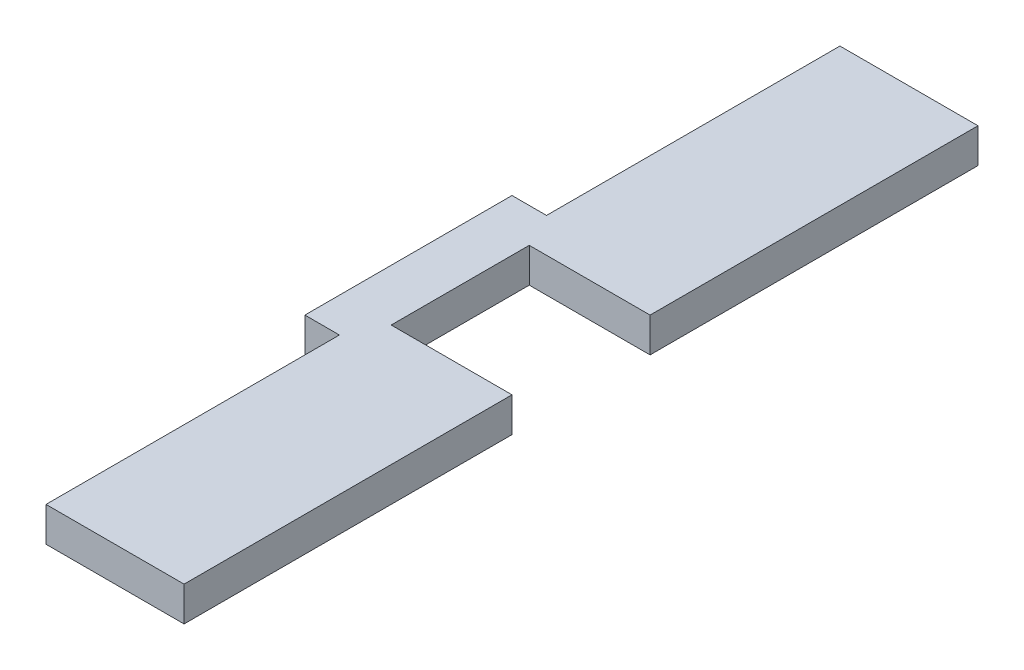
ISO-10303-21;
HEADER;
FILE_DESCRIPTION(('STEP AP214'),'2;1');
FILE_NAME('part.step','',(''),(''),'','','');
FILE_SCHEMA(('AUTOMOTIVE_DESIGN { 1 0 10303 214 1 1 1 1 }'));
ENDSEC;
DATA;
#1=APPLICATION_CONTEXT('core data for automotive mechanical design processes');
#2=APPLICATION_PROTOCOL_DEFINITION('international standard','automotive_design',2000,#1);
#3=PRODUCT_CONTEXT('',#1,'mechanical');
#4=PRODUCT('Part','Part','',(#3));
#5=PRODUCT_RELATED_PRODUCT_CATEGORY('part','',(#4));
#6=PRODUCT_DEFINITION_FORMATION('','',#4);
#7=PRODUCT_DEFINITION_CONTEXT('part definition',#1,'design');
#8=PRODUCT_DEFINITION('design','',#6,#7);
#9=PRODUCT_DEFINITION_SHAPE('','',#8);
#10=(LENGTH_UNIT() NAMED_UNIT(*) SI_UNIT(.MILLI.,.METRE.));
#11=(NAMED_UNIT(*) PLANE_ANGLE_UNIT() SI_UNIT($,.RADIAN.));
#12=(NAMED_UNIT(*) SI_UNIT($,.STERADIAN.) SOLID_ANGLE_UNIT());
#13=UNCERTAINTY_MEASURE_WITH_UNIT(LENGTH_MEASURE(1.E-05),#10,'distance_accuracy_value','');
#14=(GEOMETRIC_REPRESENTATION_CONTEXT(3) GLOBAL_UNCERTAINTY_ASSIGNED_CONTEXT((#13)) GLOBAL_UNIT_ASSIGNED_CONTEXT((#10,
#11,#12)) REPRESENTATION_CONTEXT('',''));
#15=CARTESIAN_POINT('',(0.,0.,0.));
#16=DIRECTION('',(0.,0.,1.));
#17=DIRECTION('',(1.,0.,0.));
#18=AXIS2_PLACEMENT_3D('',#15,#16,#17);
#19=CARTESIAN_POINT('',(12.7,3.175,0.));
#20=DIRECTION('',(-1.,0.,0.));
#21=DIRECTION('',(0.,0.,1.));
#22=AXIS2_PLACEMENT_3D('',#19,#20,#21);
#23=PLANE('',#22);
#24=DIRECTION('',(0.,0.,-1.));
#25=VECTOR('',#24,1.);
#26=CARTESIAN_POINT('',(12.7,0.,0.));
#27=LINE('',#26,#25);
#28=CARTESIAN_POINT('',(12.7,0.,-42.8625));
#29=VERTEX_POINT('',#28);
#30=CARTESIAN_POINT('',(12.7,0.,-73.025));
#31=VERTEX_POINT('',#30);
#32=EDGE_CURVE('E187',#29,#31,#27,.T.);
#33=ORIENTED_EDGE('',*,*,#32,.T.);
#34=DIRECTION('',(0.,-1.,0.));
#35=VECTOR('',#34,1.);
#36=CARTESIAN_POINT('',(12.7,3.175,-73.025));
#37=LINE('',#36,#35);
#38=CARTESIAN_POINT('',(12.7,3.175,-73.025));
#39=VERTEX_POINT('',#38);
#40=EDGE_CURVE('E194',#39,#31,#37,.T.);
#41=ORIENTED_EDGE('',*,*,#40,.F.);
#42=DIRECTION('',(0.,0.,-1.));
#43=VECTOR('',#42,1.);
#44=CARTESIAN_POINT('',(12.7,3.175,0.));
#45=LINE('',#44,#43);
#46=CARTESIAN_POINT('',(12.7,3.175,-42.8625));
#47=VERTEX_POINT('',#46);
#48=EDGE_CURVE('E251',#47,#39,#45,.T.);
#49=ORIENTED_EDGE('',*,*,#48,.F.);
#50=DIRECTION('',(0.,-1.,0.));
#51=VECTOR('',#50,1.);
#52=CARTESIAN_POINT('',(12.7,3.175,-42.8625));
#53=LINE('',#52,#51);
#54=EDGE_CURVE('E197',#47,#29,#53,.T.);
#55=ORIENTED_EDGE('',*,*,#54,.T.);
#56=EDGE_LOOP('',(#33,#41,#49,#55));
#57=FACE_BOUND('',#56,.T.);
#58=ADVANCED_FACE('F73',(#57),#23,.F.);
#59=CARTESIAN_POINT('',(0.,3.175,-42.8625));
#60=DIRECTION('',(0.,0.,-1.));
#61=DIRECTION('',(-1.,0.,0.));
#62=AXIS2_PLACEMENT_3D('',#59,#60,#61);
#63=PLANE('',#62);
#64=DIRECTION('',(1.,0.,0.));
#65=VECTOR('',#64,1.);
#66=CARTESIAN_POINT('',(0.,0.,-42.8625));
#67=LINE('',#66,#65);
#68=CARTESIAN_POINT('',(1.5875,0.,-42.8625));
#69=VERTEX_POINT('',#68);
#70=EDGE_CURVE('E184',#69,#29,#67,.T.);
#71=ORIENTED_EDGE('',*,*,#70,.T.);
#72=ORIENTED_EDGE('',*,*,#54,.F.);
#73=DIRECTION('',(1.,0.,0.));
#74=VECTOR('',#73,1.);
#75=CARTESIAN_POINT('',(0.,3.175,-42.8625));
#76=LINE('',#75,#74);
#77=CARTESIAN_POINT('',(1.5875,3.175,-42.8625));
#78=VERTEX_POINT('',#77);
#79=EDGE_CURVE('E249',#78,#47,#76,.T.);
#80=ORIENTED_EDGE('',*,*,#79,.F.);
#81=DIRECTION('',(0.,-1.,0.));
#82=VECTOR('',#81,1.);
#83=CARTESIAN_POINT('',(1.5875,3.175,-42.8625));
#84=LINE('',#83,#82);
#85=EDGE_CURVE('E200',#78,#69,#84,.T.);
#86=ORIENTED_EDGE('',*,*,#85,.T.);
#87=EDGE_LOOP('',(#71,#72,#80,#86));
#88=FACE_BOUND('',#87,.T.);
#89=ADVANCED_FACE('F295',(#88),#63,.F.);
#90=CARTESIAN_POINT('',(1.5875,3.175,0.));
#91=DIRECTION('',(1.,0.,0.));
#92=DIRECTION('',(0.,0.,-1.));
#93=AXIS2_PLACEMENT_3D('',#90,#91,#92);
#94=PLANE('',#93);
#95=DIRECTION('',(0.,0.,1.));
#96=VECTOR('',#95,1.);
#97=CARTESIAN_POINT('',(1.5875,0.,0.));
#98=LINE('',#97,#96);
#99=CARTESIAN_POINT('',(1.5875,0.,-30.1625));
#100=VERTEX_POINT('',#99);
#101=EDGE_CURVE('E181',#69,#100,#98,.T.);
#102=ORIENTED_EDGE('',*,*,#101,.F.);
#103=ORIENTED_EDGE('',*,*,#85,.F.);
#104=DIRECTION('',(0.,0.,1.));
#105=VECTOR('',#104,1.);
#106=CARTESIAN_POINT('',(1.5875,3.175,0.));
#107=LINE('',#106,#105);
#108=CARTESIAN_POINT('',(1.5875,3.175,-30.1625));
#109=VERTEX_POINT('',#108);
#110=EDGE_CURVE('E246',#78,#109,#107,.T.);
#111=ORIENTED_EDGE('',*,*,#110,.T.);
#112=DIRECTION('',(0.,-1.,0.));
#113=VECTOR('',#112,1.);
#114=CARTESIAN_POINT('',(1.5875,3.175,-30.1625));
#115=LINE('',#114,#113);
#116=EDGE_CURVE('E203',#109,#100,#115,.T.);
#117=ORIENTED_EDGE('',*,*,#116,.T.);
#118=EDGE_LOOP('',(#102,#103,#111,#117));
#119=FACE_BOUND('',#118,.T.);
#120=ADVANCED_FACE('F290',(#119),#94,.T.);
#121=CARTESIAN_POINT('',(0.,3.175,-30.1625));
#122=DIRECTION('',(0.,0.,-1.));
#123=DIRECTION('',(-1.,0.,0.));
#124=AXIS2_PLACEMENT_3D('',#121,#122,#123);
#125=PLANE('',#124);
#126=DIRECTION('',(1.,0.,0.));
#127=VECTOR('',#126,1.);
#128=CARTESIAN_POINT('',(0.,0.,-30.1625));
#129=LINE('',#128,#127);
#130=CARTESIAN_POINT('',(12.7,0.,-30.1625));
#131=VERTEX_POINT('',#130);
#132=EDGE_CURVE('E178',#100,#131,#129,.T.);
#133=ORIENTED_EDGE('',*,*,#132,.F.);
#134=ORIENTED_EDGE('',*,*,#116,.F.);
#135=DIRECTION('',(1.,0.,0.));
#136=VECTOR('',#135,1.);
#137=CARTESIAN_POINT('',(0.,3.175,-30.1625));
#138=LINE('',#137,#136);
#139=CARTESIAN_POINT('',(12.7,3.175,-30.1625));
#140=VERTEX_POINT('',#139);
#141=EDGE_CURVE('E240',#109,#140,#138,.T.);
#142=ORIENTED_EDGE('',*,*,#141,.T.);
#143=DIRECTION('',(0.,-1.,0.));
#144=VECTOR('',#143,1.);
#145=CARTESIAN_POINT('',(12.7,3.175,-30.1625));
#146=LINE('',#145,#144);
#147=EDGE_CURVE('E206',#140,#131,#146,.T.);
#148=ORIENTED_EDGE('',*,*,#147,.T.);
#149=EDGE_LOOP('',(#133,#134,#142,#148));
#150=FACE_BOUND('',#149,.T.);
#151=ADVANCED_FACE('F301',(#150),#125,.T.);
#152=CARTESIAN_POINT('',(12.7,3.175,0.));
#153=DIRECTION('',(-1.,0.,0.));
#154=DIRECTION('',(0.,0.,1.));
#155=AXIS2_PLACEMENT_3D('',#152,#153,#154);
#156=PLANE('',#155);
#157=DIRECTION('',(0.,0.,-1.));
#158=VECTOR('',#157,1.);
#159=CARTESIAN_POINT('',(12.7,0.,0.));
#160=LINE('',#159,#158);
#161=CARTESIAN_POINT('',(12.7,0.,0.));
#162=VERTEX_POINT('',#161);
#163=EDGE_CURVE('E175',#162,#131,#160,.T.);
#164=ORIENTED_EDGE('',*,*,#163,.T.);
#165=ORIENTED_EDGE('',*,*,#147,.F.);
#166=DIRECTION('',(0.,0.,-1.));
#167=VECTOR('',#166,1.);
#168=CARTESIAN_POINT('',(12.7,3.175,0.));
#169=LINE('',#168,#167);
#170=CARTESIAN_POINT('',(12.7,3.175,0.));
#171=VERTEX_POINT('',#170);
#172=EDGE_CURVE('E235',#171,#140,#169,.T.);
#173=ORIENTED_EDGE('',*,*,#172,.F.);
#174=DIRECTION('',(0.,-1.,0.));
#175=VECTOR('',#174,1.);
#176=CARTESIAN_POINT('',(12.7,3.175,0.));
#177=LINE('',#176,#175);
#178=EDGE_CURVE('E209',#171,#162,#177,.T.);
#179=ORIENTED_EDGE('',*,*,#178,.T.);
#180=EDGE_LOOP('',(#164,#165,#173,#179));
#181=FACE_BOUND('',#180,.T.);
#182=ADVANCED_FACE('F318',(#181),#156,.F.);
#183=CARTESIAN_POINT('',(0.,3.175,-73.025));
#184=DIRECTION('',(0.,0.,-1.));
#185=DIRECTION('',(-1.,0.,0.));
#186=AXIS2_PLACEMENT_3D('',#183,#184,#185);
#187=PLANE('',#186);
#188=DIRECTION('',(1.,0.,0.));
#189=VECTOR('',#188,1.);
#190=CARTESIAN_POINT('',(0.,0.,-73.025));
#191=LINE('',#190,#189);
#192=CARTESIAN_POINT('',(0.,0.,-73.025));
#193=VERTEX_POINT('',#192);
#194=EDGE_CURVE('E190',#193,#31,#191,.T.);
#195=ORIENTED_EDGE('',*,*,#194,.F.);
#196=DIRECTION('',(0.,-1.,0.));
#197=VECTOR('',#196,1.);
#198=CARTESIAN_POINT('',(0.,3.175,-73.025));
#199=LINE('',#198,#197);
#200=CARTESIAN_POINT('',(0.,3.175,-73.025));
#201=VERTEX_POINT('',#200);
#202=EDGE_CURVE('E155',#201,#193,#199,.T.);
#203=ORIENTED_EDGE('',*,*,#202,.F.);
#204=DIRECTION('',(1.,0.,0.));
#205=VECTOR('',#204,1.);
#206=CARTESIAN_POINT('',(0.,3.175,-73.025));
#207=LINE('',#206,#205);
#208=EDGE_CURVE('E170',#201,#39,#207,.T.);
#209=ORIENTED_EDGE('',*,*,#208,.T.);
#210=ORIENTED_EDGE('',*,*,#40,.T.);
#211=EDGE_LOOP('',(#195,#203,#209,#210));
#212=FACE_BOUND('',#211,.T.);
#213=ADVANCED_FACE('F256',(#212),#187,.T.);
#214=CARTESIAN_POINT('',(0.,3.175,0.));
#215=DIRECTION('',(0.,0.,-1.));
#216=DIRECTION('',(-1.,0.,0.));
#217=AXIS2_PLACEMENT_3D('',#214,#215,#216);
#218=PLANE('',#217);
#219=DIRECTION('',(1.,0.,0.));
#220=VECTOR('',#219,1.);
#221=CARTESIAN_POINT('',(0.,0.,0.));
#222=LINE('',#221,#220);
#223=CARTESIAN_POINT('',(0.,0.,0.));
#224=VERTEX_POINT('',#223);
#225=EDGE_CURVE('E158',#224,#162,#222,.T.);
#226=ORIENTED_EDGE('',*,*,#225,.T.);
#227=ORIENTED_EDGE('',*,*,#178,.F.);
#228=DIRECTION('',(1.,0.,0.));
#229=VECTOR('',#228,1.);
#230=CARTESIAN_POINT('',(0.,3.175,0.));
#231=LINE('',#230,#229);
#232=CARTESIAN_POINT('',(0.,3.175,0.));
#233=VERTEX_POINT('',#232);
#234=EDGE_CURVE('E233',#233,#171,#231,.T.);
#235=ORIENTED_EDGE('',*,*,#234,.F.);
#236=DIRECTION('',(0.,-1.,0.));
#237=VECTOR('',#236,1.);
#238=CARTESIAN_POINT('',(0.,3.175,0.));
#239=LINE('',#238,#237);
#240=EDGE_CURVE('E211',#233,#224,#239,.T.);
#241=ORIENTED_EDGE('',*,*,#240,.T.);
#242=EDGE_LOOP('',(#226,#227,#235,#241));
#243=FACE_BOUND('',#242,.T.);
#244=ADVANCED_FACE('F322',(#243),#218,.F.);
#245=CARTESIAN_POINT('',(0.,0.,0.));
#246=DIRECTION('',(0.,1.,0.));
#247=DIRECTION('',(0.,0.,1.));
#248=AXIS2_PLACEMENT_3D('',#245,#246,#247);
#249=PLANE('',#248);
#250=DIRECTION('',(0.,0.,-1.));
#251=VECTOR('',#250,1.);
#252=CARTESIAN_POINT('',(0.,0.,0.));
#253=LINE('',#252,#251);
#254=CARTESIAN_POINT('',(0.,0.,-26.9875));
#255=VERTEX_POINT('',#254);
#256=EDGE_CURVE('E134',#224,#255,#253,.T.);
#257=ORIENTED_EDGE('',*,*,#256,.T.);
#258=DIRECTION('',(-1.,0.,0.));
#259=VECTOR('',#258,1.);
#260=CARTESIAN_POINT('',(0.,0.,-26.9875));
#261=LINE('',#260,#259);
#262=CARTESIAN_POINT('',(-3.175,0.,-26.9875));
#263=VERTEX_POINT('',#262);
#264=EDGE_CURVE('E119',#255,#263,#261,.T.);
#265=ORIENTED_EDGE('',*,*,#264,.T.);
#266=DIRECTION('',(0.,0.,1.));
#267=VECTOR('',#266,1.);
#268=CARTESIAN_POINT('',(-3.175,0.,-46.0375));
#269=LINE('',#268,#267);
#270=CARTESIAN_POINT('',(-3.175,0.,-46.0375));
#271=VERTEX_POINT('',#270);
#272=EDGE_CURVE('E109',#271,#263,#269,.T.);
#273=ORIENTED_EDGE('',*,*,#272,.F.);
#274=DIRECTION('',(-1.,0.,0.));
#275=VECTOR('',#274,1.);
#276=CARTESIAN_POINT('',(0.,0.,-46.0375));
#277=LINE('',#276,#275);
#278=CARTESIAN_POINT('',(0.,0.,-46.0375));
#279=VERTEX_POINT('',#278);
#280=EDGE_CURVE('E129',#279,#271,#277,.T.);
#281=ORIENTED_EDGE('',*,*,#280,.F.);
#282=EDGE_CURVE('E151',#279,#193,#253,.T.);
#283=ORIENTED_EDGE('',*,*,#282,.T.);
#284=ORIENTED_EDGE('',*,*,#194,.T.);
#285=ORIENTED_EDGE('',*,*,#32,.F.);
#286=ORIENTED_EDGE('',*,*,#70,.F.);
#287=ORIENTED_EDGE('',*,*,#101,.T.);
#288=ORIENTED_EDGE('',*,*,#132,.T.);
#289=ORIENTED_EDGE('',*,*,#163,.F.);
#290=ORIENTED_EDGE('',*,*,#225,.F.);
#291=EDGE_LOOP('',(#257,#265,#273,#281,#283,#284,#285,#286,#287,#288,#289,#290));
#292=FACE_BOUND('',#291,.T.);
#293=ADVANCED_FACE('F131',(#292),#249,.F.);
#294=CARTESIAN_POINT('',(0.,3.175,0.));
#295=DIRECTION('',(0.,1.,0.));
#296=DIRECTION('',(0.,0.,1.));
#297=AXIS2_PLACEMENT_3D('',#294,#295,#296);
#298=PLANE('',#297);
#299=DIRECTION('',(0.,0.,-1.));
#300=VECTOR('',#299,1.);
#301=CARTESIAN_POINT('',(0.,3.175,0.));
#302=LINE('',#301,#300);
#303=CARTESIAN_POINT('',(0.,3.175,-26.9875));
#304=VERTEX_POINT('',#303);
#305=EDGE_CURVE('E164',#233,#304,#302,.T.);
#306=ORIENTED_EDGE('',*,*,#305,.F.);
#307=ORIENTED_EDGE('',*,*,#234,.T.);
#308=ORIENTED_EDGE('',*,*,#172,.T.);
#309=ORIENTED_EDGE('',*,*,#141,.F.);
#310=ORIENTED_EDGE('',*,*,#110,.F.);
#311=ORIENTED_EDGE('',*,*,#79,.T.);
#312=ORIENTED_EDGE('',*,*,#48,.T.);
#313=ORIENTED_EDGE('',*,*,#208,.F.);
#314=CARTESIAN_POINT('',(0.,3.175,-46.0375));
#315=VERTEX_POINT('',#314);
#316=EDGE_CURVE('E192',#315,#201,#302,.T.);
#317=ORIENTED_EDGE('',*,*,#316,.F.);
#318=DIRECTION('',(-1.,0.,0.));
#319=VECTOR('',#318,1.);
#320=CARTESIAN_POINT('',(0.,3.175,-46.0375));
#321=LINE('',#320,#319);
#322=CARTESIAN_POINT('',(-3.175,3.175,-46.0375));
#323=VERTEX_POINT('',#322);
#324=EDGE_CURVE('E135',#315,#323,#321,.T.);
#325=ORIENTED_EDGE('',*,*,#324,.T.);
#326=DIRECTION('',(0.,0.,1.));
#327=VECTOR('',#326,1.);
#328=CARTESIAN_POINT('',(-3.175,3.175,-46.0375));
#329=LINE('',#328,#327);
#330=CARTESIAN_POINT('',(-3.175,3.175,-26.9875));
#331=VERTEX_POINT('',#330);
#332=EDGE_CURVE('E138',#323,#331,#329,.T.);
#333=ORIENTED_EDGE('',*,*,#332,.T.);
#334=DIRECTION('',(-1.,0.,0.));
#335=VECTOR('',#334,1.);
#336=CARTESIAN_POINT('',(0.,3.175,-26.9875));
#337=LINE('',#336,#335);
#338=EDGE_CURVE('E122',#304,#331,#337,.T.);
#339=ORIENTED_EDGE('',*,*,#338,.F.);
#340=EDGE_LOOP('',(#306,#307,#308,#309,#310,#311,#312,#313,#317,#325,#333,#339));
#341=FACE_BOUND('',#340,.T.);
#342=ADVANCED_FACE('F227',(#341),#298,.T.);
#343=CARTESIAN_POINT('',(0.,3.175,0.));
#344=DIRECTION('',(-1.,0.,0.));
#345=DIRECTION('',(0.,0.,1.));
#346=AXIS2_PLACEMENT_3D('',#343,#344,#345);
#347=PLANE('',#346);
#348=ORIENTED_EDGE('',*,*,#305,.T.);
#349=DIRECTION('',(0.,-1.,0.));
#350=VECTOR('',#349,1.);
#351=CARTESIAN_POINT('',(0.,3.175,-26.9875));
#352=LINE('',#351,#350);
#353=EDGE_CURVE('E83',#304,#255,#352,.T.);
#354=ORIENTED_EDGE('',*,*,#353,.T.);
#355=ORIENTED_EDGE('',*,*,#256,.F.);
#356=ORIENTED_EDGE('',*,*,#240,.F.);
#357=EDGE_LOOP('',(#348,#354,#355,#356));
#358=FACE_BOUND('',#357,.T.);
#359=ADVANCED_FACE('F327',(#358),#347,.T.);
#360=DIRECTION('',(0.,-1.,0.));
#361=VECTOR('',#360,1.);
#362=CARTESIAN_POINT('',(0.,3.175,-46.0375));
#363=LINE('',#362,#361);
#364=EDGE_CURVE('E12',#315,#279,#363,.T.);
#365=ORIENTED_EDGE('',*,*,#364,.F.);
#366=ORIENTED_EDGE('',*,*,#316,.T.);
#367=ORIENTED_EDGE('',*,*,#202,.T.);
#368=ORIENTED_EDGE('',*,*,#282,.F.);
#369=EDGE_LOOP('',(#365,#366,#367,#368));
#370=FACE_BOUND('',#369,.T.);
#371=ADVANCED_FACE('F153',(#370),#347,.T.);
#372=CARTESIAN_POINT('',(-3.175,3.175,-46.0375));
#373=DIRECTION('',(1.,0.,0.));
#374=DIRECTION('',(0.,0.,-1.));
#375=AXIS2_PLACEMENT_3D('',#372,#373,#374);
#376=PLANE('',#375);
#377=ORIENTED_EDGE('',*,*,#272,.T.);
#378=DIRECTION('',(0.,-1.,0.));
#379=VECTOR('',#378,1.);
#380=CARTESIAN_POINT('',(-3.175,3.175,-26.9875));
#381=LINE('',#380,#379);
#382=EDGE_CURVE('E116',#331,#263,#381,.T.);
#383=ORIENTED_EDGE('',*,*,#382,.F.);
#384=ORIENTED_EDGE('',*,*,#332,.F.);
#385=DIRECTION('',(0.,-1.,0.));
#386=VECTOR('',#385,1.);
#387=CARTESIAN_POINT('',(-3.175,3.175,-46.0375));
#388=LINE('',#387,#386);
#389=EDGE_CURVE('E124',#323,#271,#388,.T.);
#390=ORIENTED_EDGE('',*,*,#389,.T.);
#391=EDGE_LOOP('',(#377,#383,#384,#390));
#392=FACE_BOUND('',#391,.T.);
#393=ADVANCED_FACE('F126',(#392),#376,.F.);
#394=CARTESIAN_POINT('',(0.,3.175,-26.9875));
#395=DIRECTION('',(0.,0.,1.));
#396=DIRECTION('',(1.,0.,0.));
#397=AXIS2_PLACEMENT_3D('',#394,#395,#396);
#398=PLANE('',#397);
#399=ORIENTED_EDGE('',*,*,#264,.F.);
#400=ORIENTED_EDGE('',*,*,#353,.F.);
#401=ORIENTED_EDGE('',*,*,#338,.T.);
#402=ORIENTED_EDGE('',*,*,#382,.T.);
#403=EDGE_LOOP('',(#399,#400,#401,#402));
#404=FACE_BOUND('',#403,.T.);
#405=ADVANCED_FACE('F117',(#404),#398,.T.);
#406=CARTESIAN_POINT('',(0.,3.175,-46.0375));
#407=DIRECTION('',(0.,0.,1.));
#408=DIRECTION('',(1.,0.,0.));
#409=AXIS2_PLACEMENT_3D('',#406,#407,#408);
#410=PLANE('',#409);
#411=ORIENTED_EDGE('',*,*,#280,.T.);
#412=ORIENTED_EDGE('',*,*,#389,.F.);
#413=ORIENTED_EDGE('',*,*,#324,.F.);
#414=ORIENTED_EDGE('',*,*,#364,.T.);
#415=EDGE_LOOP('',(#411,#412,#413,#414));
#416=FACE_BOUND('',#415,.T.);
#417=ADVANCED_FACE('F75',(#416),#410,.F.);
#418=CLOSED_SHELL('',(#58,#89,#120,#151,#182,#213,#244,#293,#342,#359,#371,#393,#405,#417));
#419=MANIFOLD_SOLID_BREP('B2',#418);
#420=ADVANCED_BREP_SHAPE_REPRESENTATION('',(#18,#419),#14);
#421=SHAPE_DEFINITION_REPRESENTATION(#9,#420);
ENDSEC;
END-ISO-10303-21;
